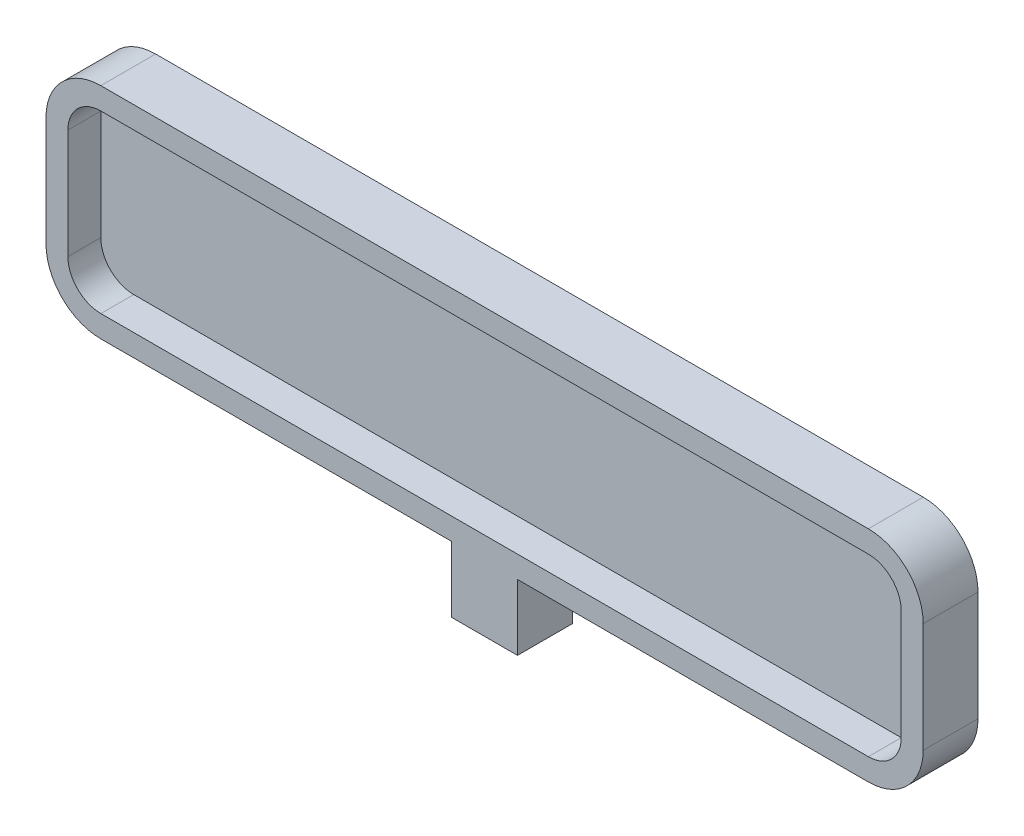
ISO-10303-21;
HEADER;
FILE_DESCRIPTION(('STEP AP214'),'2;1');
FILE_NAME('part.step','',(''),(''),'','','');
FILE_SCHEMA(('AUTOMOTIVE_DESIGN { 1 0 10303 214 1 1 1 1 }'));
ENDSEC;
DATA;
#1=APPLICATION_CONTEXT('core data for automotive mechanical design processes');
#2=APPLICATION_PROTOCOL_DEFINITION('international standard','automotive_design',2000,#1);
#3=PRODUCT_CONTEXT('',#1,'mechanical');
#4=PRODUCT('Part','Part','',(#3));
#5=PRODUCT_RELATED_PRODUCT_CATEGORY('part','',(#4));
#6=PRODUCT_DEFINITION_FORMATION('','',#4);
#7=PRODUCT_DEFINITION_CONTEXT('part definition',#1,'design');
#8=PRODUCT_DEFINITION('design','',#6,#7);
#9=PRODUCT_DEFINITION_SHAPE('','',#8);
#10=(LENGTH_UNIT() NAMED_UNIT(*) SI_UNIT(.MILLI.,.METRE.));
#11=(NAMED_UNIT(*) PLANE_ANGLE_UNIT() SI_UNIT($,.RADIAN.));
#12=(NAMED_UNIT(*) SI_UNIT($,.STERADIAN.) SOLID_ANGLE_UNIT());
#13=UNCERTAINTY_MEASURE_WITH_UNIT(LENGTH_MEASURE(1.E-05),#10,'distance_accuracy_value','');
#14=(GEOMETRIC_REPRESENTATION_CONTEXT(3) GLOBAL_UNCERTAINTY_ASSIGNED_CONTEXT((#13)) GLOBAL_UNIT_ASSIGNED_CONTEXT((#10,
#11,#12)) REPRESENTATION_CONTEXT('',''));
#15=CARTESIAN_POINT('',(0.,0.,0.));
#16=DIRECTION('',(0.,0.,1.));
#17=DIRECTION('',(1.,0.,0.));
#18=AXIS2_PLACEMENT_3D('',#15,#16,#17);
#19=CARTESIAN_POINT('',(40.,-10.,5.));
#20=DIRECTION('',(0.,1.,0.));
#21=DIRECTION('',(-1.,0.,0.));
#22=AXIS2_PLACEMENT_3D('',#19,#20,#21);
#23=PLANE('',#22);
#24=DIRECTION('',(0.,0.,1.));
#25=VECTOR('',#24,1.);
#26=CARTESIAN_POINT('',(3.,-10.,0.));
#27=LINE('',#26,#25);
#28=CARTESIAN_POINT('',(3.,-10.,0.));
#29=VERTEX_POINT('',#28);
#30=CARTESIAN_POINT('',(3.,-10.,5.));
#31=VERTEX_POINT('',#30);
#32=EDGE_CURVE('E203',#29,#31,#27,.T.);
#33=ORIENTED_EDGE('',*,*,#32,.F.);
#34=DIRECTION('',(1.,0.,0.));
#35=VECTOR('',#34,1.);
#36=CARTESIAN_POINT('',(40.,-10.,0.));
#37=LINE('',#36,#35);
#38=CARTESIAN_POINT('',(35.,-10.,0.));
#39=VERTEX_POINT('',#38);
#40=EDGE_CURVE('E315',#29,#39,#37,.T.);
#41=ORIENTED_EDGE('',*,*,#40,.T.);
#42=DIRECTION('',(0.,0.,-1.));
#43=VECTOR('',#42,1.);
#44=CARTESIAN_POINT('',(35.,-10.,5.));
#45=LINE('',#44,#43);
#46=CARTESIAN_POINT('',(35.,-10.,5.));
#47=VERTEX_POINT('',#46);
#48=EDGE_CURVE('E311',#39,#47,#45,.F.);
#49=ORIENTED_EDGE('',*,*,#48,.T.);
#50=DIRECTION('',(1.,0.,0.));
#51=VECTOR('',#50,1.);
#52=CARTESIAN_POINT('',(40.,-10.,5.));
#53=LINE('',#52,#51);
#54=EDGE_CURVE('E55',#31,#47,#53,.T.);
#55=ORIENTED_EDGE('',*,*,#54,.F.);
#56=EDGE_LOOP('',(#33,#41,#49,#55));
#57=FACE_BOUND('',#56,.T.);
#58=ADVANCED_FACE('F39',(#57),#23,.F.);
#59=DIRECTION('',(0.,0.,-1.));
#60=VECTOR('',#59,1.);
#61=CARTESIAN_POINT('',(-3.,-10.,0.));
#62=LINE('',#61,#60);
#63=CARTESIAN_POINT('',(-3.,-10.,5.));
#64=VERTEX_POINT('',#63);
#65=CARTESIAN_POINT('',(-3.,-10.,0.));
#66=VERTEX_POINT('',#65);
#67=EDGE_CURVE('E63',#64,#66,#62,.T.);
#68=ORIENTED_EDGE('',*,*,#67,.F.);
#69=CARTESIAN_POINT('',(-35.,-10.,5.));
#70=VERTEX_POINT('',#69);
#71=EDGE_CURVE('E300',#70,#64,#53,.T.);
#72=ORIENTED_EDGE('',*,*,#71,.F.);
#73=DIRECTION('',(0.,0.,-1.));
#74=VECTOR('',#73,1.);
#75=CARTESIAN_POINT('',(-35.,-10.,5.));
#76=LINE('',#75,#74);
#77=CARTESIAN_POINT('',(-35.,-10.,0.));
#78=VERTEX_POINT('',#77);
#79=EDGE_CURVE('E328',#70,#78,#76,.T.);
#80=ORIENTED_EDGE('',*,*,#79,.T.);
#81=EDGE_CURVE('E316',#78,#66,#37,.T.);
#82=ORIENTED_EDGE('',*,*,#81,.T.);
#83=EDGE_LOOP('',(#68,#72,#80,#82));
#84=FACE_BOUND('',#83,.T.);
#85=ADVANCED_FACE('F394',(#84),#23,.F.);
#86=CARTESIAN_POINT('',(-40.,9.99999999999999,5.));
#87=DIRECTION('',(1.,0.,0.));
#88=DIRECTION('',(0.,1.,0.));
#89=AXIS2_PLACEMENT_3D('',#86,#87,#88);
#90=PLANE('',#89);
#91=DIRECTION('',(0.,-1.,0.));
#92=VECTOR('',#91,1.);
#93=CARTESIAN_POINT('',(-40.,9.99999999999999,0.));
#94=LINE('',#93,#92);
#95=CARTESIAN_POINT('',(-40.,4.99999999999999,0.));
#96=VERTEX_POINT('',#95);
#97=CARTESIAN_POINT('',(-40.,-5.00000000000001,0.));
#98=VERTEX_POINT('',#97);
#99=EDGE_CURVE('E269',#96,#98,#94,.T.);
#100=ORIENTED_EDGE('',*,*,#99,.T.);
#101=DIRECTION('',(0.,0.,-1.));
#102=VECTOR('',#101,1.);
#103=CARTESIAN_POINT('',(-40.,-5.00000000000001,5.));
#104=LINE('',#103,#102);
#105=CARTESIAN_POINT('',(-40.,-5.00000000000001,5.));
#106=VERTEX_POINT('',#105);
#107=EDGE_CURVE('E349',#98,#106,#104,.F.);
#108=ORIENTED_EDGE('',*,*,#107,.T.);
#109=DIRECTION('',(0.,-1.,0.));
#110=VECTOR('',#109,1.);
#111=CARTESIAN_POINT('',(-40.,9.99999999999999,5.));
#112=LINE('',#111,#110);
#113=CARTESIAN_POINT('',(-40.,4.99999999999999,5.));
#114=VERTEX_POINT('',#113);
#115=EDGE_CURVE('E296',#114,#106,#112,.T.);
#116=ORIENTED_EDGE('',*,*,#115,.F.);
#117=DIRECTION('',(0.,0.,-1.));
#118=VECTOR('',#117,1.);
#119=CARTESIAN_POINT('',(-40.,4.99999999999999,5.));
#120=LINE('',#119,#118);
#121=EDGE_CURVE('E345',#114,#96,#120,.T.);
#122=ORIENTED_EDGE('',*,*,#121,.T.);
#123=EDGE_LOOP('',(#100,#108,#116,#122));
#124=FACE_BOUND('',#123,.T.);
#125=ADVANCED_FACE('F384',(#124),#90,.F.);
#126=CARTESIAN_POINT('',(40.,10.,5.));
#127=DIRECTION('',(-1.,0.,0.));
#128=DIRECTION('',(0.,0.,1.));
#129=AXIS2_PLACEMENT_3D('',#126,#127,#128);
#130=PLANE('',#129);
#131=DIRECTION('',(0.,1.,0.));
#132=VECTOR('',#131,1.);
#133=CARTESIAN_POINT('',(40.,10.,5.));
#134=LINE('',#133,#132);
#135=CARTESIAN_POINT('',(40.,-5.,5.));
#136=VERTEX_POINT('',#135);
#137=CARTESIAN_POINT('',(40.,5.,5.));
#138=VERTEX_POINT('',#137);
#139=EDGE_CURVE('E303',#136,#138,#134,.T.);
#140=ORIENTED_EDGE('',*,*,#139,.F.);
#141=DIRECTION('',(0.,0.,-1.));
#142=VECTOR('',#141,1.);
#143=CARTESIAN_POINT('',(40.,-5.,5.));
#144=LINE('',#143,#142);
#145=CARTESIAN_POINT('',(40.,-5.,0.));
#146=VERTEX_POINT('',#145);
#147=EDGE_CURVE('E367',#136,#146,#144,.T.);
#148=ORIENTED_EDGE('',*,*,#147,.T.);
#149=DIRECTION('',(0.,1.,0.));
#150=VECTOR('',#149,1.);
#151=CARTESIAN_POINT('',(40.,10.,0.));
#152=LINE('',#151,#150);
#153=CARTESIAN_POINT('',(40.,5.,0.));
#154=VERTEX_POINT('',#153);
#155=EDGE_CURVE('E319',#146,#154,#152,.T.);
#156=ORIENTED_EDGE('',*,*,#155,.T.);
#157=DIRECTION('',(0.,0.,-1.));
#158=VECTOR('',#157,1.);
#159=CARTESIAN_POINT('',(40.,5.,5.));
#160=LINE('',#159,#158);
#161=EDGE_CURVE('E364',#154,#138,#160,.F.);
#162=ORIENTED_EDGE('',*,*,#161,.T.);
#163=EDGE_LOOP('',(#140,#148,#156,#162));
#164=FACE_BOUND('',#163,.T.);
#165=ADVANCED_FACE('F421',(#164),#130,.F.);
#166=CARTESIAN_POINT('',(40.,10.,5.));
#167=DIRECTION('',(0.,-1.,0.));
#168=DIRECTION('',(1.,0.,0.));
#169=AXIS2_PLACEMENT_3D('',#166,#167,#168);
#170=PLANE('',#169);
#171=DIRECTION('',(-1.,0.,0.));
#172=VECTOR('',#171,1.);
#173=CARTESIAN_POINT('',(40.,10.,5.));
#174=LINE('',#173,#172);
#175=CARTESIAN_POINT('',(35.,10.,5.));
#176=VERTEX_POINT('',#175);
#177=CARTESIAN_POINT('',(-35.,9.99999999999999,5.));
#178=VERTEX_POINT('',#177);
#179=EDGE_CURVE('E307',#176,#178,#174,.T.);
#180=ORIENTED_EDGE('',*,*,#179,.F.);
#181=DIRECTION('',(0.,0.,-1.));
#182=VECTOR('',#181,1.);
#183=CARTESIAN_POINT('',(35.,10.,5.));
#184=LINE('',#183,#182);
#185=CARTESIAN_POINT('',(35.,10.,0.));
#186=VERTEX_POINT('',#185);
#187=EDGE_CURVE('E11',#176,#186,#184,.T.);
#188=ORIENTED_EDGE('',*,*,#187,.T.);
#189=DIRECTION('',(-1.,0.,0.));
#190=VECTOR('',#189,1.);
#191=CARTESIAN_POINT('',(40.,10.,0.));
#192=LINE('',#191,#190);
#193=CARTESIAN_POINT('',(-35.,9.99999999999999,0.));
#194=VERTEX_POINT('',#193);
#195=EDGE_CURVE('E299',#186,#194,#192,.T.);
#196=ORIENTED_EDGE('',*,*,#195,.T.);
#197=DIRECTION('',(0.,0.,-1.));
#198=VECTOR('',#197,1.);
#199=CARTESIAN_POINT('',(-35.,9.99999999999999,5.));
#200=LINE('',#199,#198);
#201=EDGE_CURVE('E48',#194,#178,#200,.F.);
#202=ORIENTED_EDGE('',*,*,#201,.T.);
#203=EDGE_LOOP('',(#180,#188,#196,#202));
#204=FACE_BOUND('',#203,.T.);
#205=ADVANCED_FACE('F374',(#204),#170,.F.);
#206=CARTESIAN_POINT('',(0.,0.,5.));
#207=DIRECTION('',(0.,0.,-1.));
#208=DIRECTION('',(-1.,0.,0.));
#209=AXIS2_PLACEMENT_3D('',#206,#207,#208);
#210=PLANE('',#209);
#211=DIRECTION('',(0.,-1.,0.));
#212=VECTOR('',#211,1.);
#213=CARTESIAN_POINT('',(-38.,0.,5.));
#214=LINE('',#213,#212);
#215=CARTESIAN_POINT('',(-38.,4.99999999999999,5.));
#216=VERTEX_POINT('',#215);
#217=CARTESIAN_POINT('',(-38.,-5.00000000000001,5.));
#218=VERTEX_POINT('',#217);
#219=EDGE_CURVE('E241',#216,#218,#214,.T.);
#220=ORIENTED_EDGE('',*,*,#219,.F.);
#221=CARTESIAN_POINT('',(-35.,4.99999999999999,5.));
#222=DIRECTION('',(0.,0.,-1.));
#223=DIRECTION('',(-1.,0.,0.));
#224=AXIS2_PLACEMENT_3D('',#221,#222,#223);
#225=CIRCLE('',#224,3.);
#226=CARTESIAN_POINT('',(-35.,7.99999999999999,5.));
#227=VERTEX_POINT('',#226);
#228=EDGE_CURVE('E219',#227,#216,#225,.F.);
#229=ORIENTED_EDGE('',*,*,#228,.F.);
#230=DIRECTION('',(-1.,0.,0.));
#231=VECTOR('',#230,1.);
#232=CARTESIAN_POINT('',(0.,7.99999999999999,5.));
#233=LINE('',#232,#231);
#234=CARTESIAN_POINT('',(35.,8.,5.));
#235=VERTEX_POINT('',#234);
#236=EDGE_CURVE('E255',#235,#227,#233,.T.);
#237=ORIENTED_EDGE('',*,*,#236,.F.);
#238=CARTESIAN_POINT('',(35.,5.,5.));
#239=DIRECTION('',(0.,0.,-1.));
#240=DIRECTION('',(-1.,0.,0.));
#241=AXIS2_PLACEMENT_3D('',#238,#239,#240);
#242=CIRCLE('',#241,3.);
#243=CARTESIAN_POINT('',(38.,5.,5.));
#244=VERTEX_POINT('',#243);
#245=EDGE_CURVE('E286',#244,#235,#242,.F.);
#246=ORIENTED_EDGE('',*,*,#245,.F.);
#247=DIRECTION('',(0.,1.,0.));
#248=VECTOR('',#247,1.);
#249=CARTESIAN_POINT('',(38.,0.,5.));
#250=LINE('',#249,#248);
#251=CARTESIAN_POINT('',(38.,-5.,5.));
#252=VERTEX_POINT('',#251);
#253=EDGE_CURVE('E283',#252,#244,#250,.T.);
#254=ORIENTED_EDGE('',*,*,#253,.F.);
#255=CARTESIAN_POINT('',(35.,-5.,5.));
#256=DIRECTION('',(0.,0.,-1.));
#257=DIRECTION('',(-1.,0.,0.));
#258=AXIS2_PLACEMENT_3D('',#255,#256,#257);
#259=CIRCLE('',#258,3.);
#260=CARTESIAN_POINT('',(35.,-8.,5.));
#261=VERTEX_POINT('',#260);
#262=EDGE_CURVE('E279',#261,#252,#259,.F.);
#263=ORIENTED_EDGE('',*,*,#262,.F.);
#264=DIRECTION('',(1.,0.,0.));
#265=VECTOR('',#264,1.);
#266=CARTESIAN_POINT('',(0.,-8.00000000000001,5.));
#267=LINE('',#266,#265);
#268=CARTESIAN_POINT('',(-35.,-8.00000000000001,5.));
#269=VERTEX_POINT('',#268);
#270=EDGE_CURVE('E276',#269,#261,#267,.T.);
#271=ORIENTED_EDGE('',*,*,#270,.F.);
#272=CARTESIAN_POINT('',(-35.,-5.00000000000001,5.));
#273=DIRECTION('',(0.,0.,-1.));
#274=DIRECTION('',(-1.,0.,0.));
#275=AXIS2_PLACEMENT_3D('',#272,#273,#274);
#276=CIRCLE('',#275,3.);
#277=EDGE_CURVE('E264',#218,#269,#276,.F.);
#278=ORIENTED_EDGE('',*,*,#277,.F.);
#279=EDGE_LOOP('',(#220,#229,#237,#246,#254,#263,#271,#278));
#280=FACE_BOUND('',#279,.T.);
#281=ORIENTED_EDGE('',*,*,#115,.T.);
#282=CARTESIAN_POINT('',(-35.,-5.00000000000001,5.));
#283=DIRECTION('',(0.,0.,-1.));
#284=DIRECTION('',(-1.,0.,0.));
#285=AXIS2_PLACEMENT_3D('',#282,#283,#284);
#286=CIRCLE('',#285,5.);
#287=EDGE_CURVE('E361',#106,#70,#286,.F.);
#288=ORIENTED_EDGE('',*,*,#287,.T.);
#289=ORIENTED_EDGE('',*,*,#71,.T.);
#290=DIRECTION('',(0.,1.,0.));
#291=VECTOR('',#290,1.);
#292=CARTESIAN_POINT('',(-3.,-16.,5.));
#293=LINE('',#292,#291);
#294=CARTESIAN_POINT('',(-3.,-16.,5.));
#295=VERTEX_POINT('',#294);
#296=EDGE_CURVE('E186',#295,#64,#293,.T.);
#297=ORIENTED_EDGE('',*,*,#296,.F.);
#298=DIRECTION('',(-1.,0.,0.));
#299=VECTOR('',#298,1.);
#300=CARTESIAN_POINT('',(-3.,-16.,5.));
#301=LINE('',#300,#299);
#302=CARTESIAN_POINT('',(3.,-16.,5.));
#303=VERTEX_POINT('',#302);
#304=EDGE_CURVE('E178',#303,#295,#301,.T.);
#305=ORIENTED_EDGE('',*,*,#304,.F.);
#306=DIRECTION('',(0.,1.,0.));
#307=VECTOR('',#306,1.);
#308=CARTESIAN_POINT('',(3.,-16.,5.));
#309=LINE('',#308,#307);
#310=EDGE_CURVE('E183',#303,#31,#309,.T.);
#311=ORIENTED_EDGE('',*,*,#310,.T.);
#312=ORIENTED_EDGE('',*,*,#54,.T.);
#313=CARTESIAN_POINT('',(35.,-5.,5.));
#314=DIRECTION('',(0.,0.,-1.));
#315=DIRECTION('',(-1.,0.,0.));
#316=AXIS2_PLACEMENT_3D('',#313,#314,#315);
#317=CIRCLE('',#316,5.);
#318=EDGE_CURVE('E358',#47,#136,#317,.F.);
#319=ORIENTED_EDGE('',*,*,#318,.T.);
#320=ORIENTED_EDGE('',*,*,#139,.T.);
#321=CARTESIAN_POINT('',(35.,5.,5.));
#322=DIRECTION('',(0.,0.,-1.));
#323=DIRECTION('',(-1.,0.,0.));
#324=AXIS2_PLACEMENT_3D('',#321,#322,#323);
#325=CIRCLE('',#324,5.);
#326=EDGE_CURVE('E355',#138,#176,#325,.F.);
#327=ORIENTED_EDGE('',*,*,#326,.T.);
#328=ORIENTED_EDGE('',*,*,#179,.T.);
#329=CARTESIAN_POINT('',(-35.,4.99999999999999,5.));
#330=DIRECTION('',(0.,0.,-1.));
#331=DIRECTION('',(-1.,0.,0.));
#332=AXIS2_PLACEMENT_3D('',#329,#330,#331);
#333=CIRCLE('',#332,5.);
#334=EDGE_CURVE('E352',#178,#114,#333,.F.);
#335=ORIENTED_EDGE('',*,*,#334,.T.);
#336=EDGE_LOOP('',(#281,#288,#289,#297,#305,#311,#312,#319,#320,#327,#328,#335));
#337=FACE_BOUND('',#336,.T.);
#338=ADVANCED_FACE('F181',(#280,#337),#210,.F.);
#339=CARTESIAN_POINT('',(0.,0.,0.));
#340=DIRECTION('',(0.,0.,-1.));
#341=DIRECTION('',(-1.,0.,0.));
#342=AXIS2_PLACEMENT_3D('',#339,#340,#341);
#343=PLANE('',#342);
#344=ORIENTED_EDGE('',*,*,#81,.F.);
#345=CARTESIAN_POINT('',(-35.,-5.00000000000001,0.));
#346=DIRECTION('',(0.,0.,-1.));
#347=DIRECTION('',(-1.,0.,0.));
#348=AXIS2_PLACEMENT_3D('',#345,#346,#347);
#349=CIRCLE('',#348,5.);
#350=EDGE_CURVE('E342',#78,#98,#349,.T.);
#351=ORIENTED_EDGE('',*,*,#350,.T.);
#352=ORIENTED_EDGE('',*,*,#99,.F.);
#353=CARTESIAN_POINT('',(-35.,4.99999999999999,0.));
#354=DIRECTION('',(0.,0.,-1.));
#355=DIRECTION('',(-1.,0.,0.));
#356=AXIS2_PLACEMENT_3D('',#353,#354,#355);
#357=CIRCLE('',#356,5.);
#358=EDGE_CURVE('E332',#96,#194,#357,.T.);
#359=ORIENTED_EDGE('',*,*,#358,.T.);
#360=ORIENTED_EDGE('',*,*,#195,.F.);
#361=CARTESIAN_POINT('',(35.,5.,0.));
#362=DIRECTION('',(0.,0.,-1.));
#363=DIRECTION('',(-1.,0.,0.));
#364=AXIS2_PLACEMENT_3D('',#361,#362,#363);
#365=CIRCLE('',#364,5.);
#366=EDGE_CURVE('E335',#186,#154,#365,.T.);
#367=ORIENTED_EDGE('',*,*,#366,.T.);
#368=ORIENTED_EDGE('',*,*,#155,.F.);
#369=CARTESIAN_POINT('',(35.,-5.,0.));
#370=DIRECTION('',(0.,0.,-1.));
#371=DIRECTION('',(-1.,0.,0.));
#372=AXIS2_PLACEMENT_3D('',#369,#370,#371);
#373=CIRCLE('',#372,5.);
#374=EDGE_CURVE('E338',#146,#39,#373,.T.);
#375=ORIENTED_EDGE('',*,*,#374,.T.);
#376=ORIENTED_EDGE('',*,*,#40,.F.);
#377=DIRECTION('',(0.,1.,0.));
#378=VECTOR('',#377,1.);
#379=CARTESIAN_POINT('',(3.,-16.,0.));
#380=LINE('',#379,#378);
#381=CARTESIAN_POINT('',(3.,-16.,0.));
#382=VERTEX_POINT('',#381);
#383=EDGE_CURVE('E401',#382,#29,#380,.T.);
#384=ORIENTED_EDGE('',*,*,#383,.F.);
#385=DIRECTION('',(1.,0.,0.));
#386=VECTOR('',#385,1.);
#387=CARTESIAN_POINT('',(-3.,-16.,0.));
#388=LINE('',#387,#386);
#389=CARTESIAN_POINT('',(-3.,-16.,0.));
#390=VERTEX_POINT('',#389);
#391=EDGE_CURVE('E196',#390,#382,#388,.T.);
#392=ORIENTED_EDGE('',*,*,#391,.F.);
#393=DIRECTION('',(0.,1.,0.));
#394=VECTOR('',#393,1.);
#395=CARTESIAN_POINT('',(-3.,-16.,0.));
#396=LINE('',#395,#394);
#397=EDGE_CURVE('E212',#390,#66,#396,.T.);
#398=ORIENTED_EDGE('',*,*,#397,.T.);
#399=EDGE_LOOP('',(#344,#351,#352,#359,#360,#367,#368,#375,#376,#384,#392,#398));
#400=FACE_BOUND('',#399,.T.);
#401=ADVANCED_FACE('F388',(#400),#343,.T.);
#402=CARTESIAN_POINT('',(-35.,-5.00000000000001,5.));
#403=DIRECTION('',(0.,0.,-1.));
#404=DIRECTION('',(-1.,0.,0.));
#405=AXIS2_PLACEMENT_3D('',#402,#403,#404);
#406=CYLINDRICAL_SURFACE('',#405,5.);
#407=ORIENTED_EDGE('',*,*,#287,.F.);
#408=ORIENTED_EDGE('',*,*,#107,.F.);
#409=ORIENTED_EDGE('',*,*,#350,.F.);
#410=ORIENTED_EDGE('',*,*,#79,.F.);
#411=EDGE_LOOP('',(#407,#408,#409,#410));
#412=FACE_BOUND('',#411,.T.);
#413=ADVANCED_FACE('F393',(#412),#406,.T.);
#414=CARTESIAN_POINT('',(35.,-5.,5.));
#415=DIRECTION('',(0.,0.,-1.));
#416=DIRECTION('',(-1.,0.,0.));
#417=AXIS2_PLACEMENT_3D('',#414,#415,#416);
#418=CYLINDRICAL_SURFACE('',#417,5.);
#419=ORIENTED_EDGE('',*,*,#318,.F.);
#420=ORIENTED_EDGE('',*,*,#48,.F.);
#421=ORIENTED_EDGE('',*,*,#374,.F.);
#422=ORIENTED_EDGE('',*,*,#147,.F.);
#423=EDGE_LOOP('',(#419,#420,#421,#422));
#424=FACE_BOUND('',#423,.T.);
#425=ADVANCED_FACE('F427',(#424),#418,.T.);
#426=CARTESIAN_POINT('',(35.,5.,5.));
#427=DIRECTION('',(0.,0.,-1.));
#428=DIRECTION('',(-1.,0.,0.));
#429=AXIS2_PLACEMENT_3D('',#426,#427,#428);
#430=CYLINDRICAL_SURFACE('',#429,5.);
#431=ORIENTED_EDGE('',*,*,#326,.F.);
#432=ORIENTED_EDGE('',*,*,#161,.F.);
#433=ORIENTED_EDGE('',*,*,#366,.F.);
#434=ORIENTED_EDGE('',*,*,#187,.F.);
#435=EDGE_LOOP('',(#431,#432,#433,#434));
#436=FACE_BOUND('',#435,.T.);
#437=ADVANCED_FACE('F429',(#436),#430,.T.);
#438=CARTESIAN_POINT('',(-35.,4.99999999999999,5.));
#439=DIRECTION('',(0.,0.,-1.));
#440=DIRECTION('',(-1.,0.,0.));
#441=AXIS2_PLACEMENT_3D('',#438,#439,#440);
#442=CYLINDRICAL_SURFACE('',#441,5.);
#443=ORIENTED_EDGE('',*,*,#334,.F.);
#444=ORIENTED_EDGE('',*,*,#201,.F.);
#445=ORIENTED_EDGE('',*,*,#358,.F.);
#446=ORIENTED_EDGE('',*,*,#121,.F.);
#447=EDGE_LOOP('',(#443,#444,#445,#446));
#448=FACE_BOUND('',#447,.T.);
#449=ADVANCED_FACE('F41',(#448),#442,.T.);
#450=CARTESIAN_POINT('',(-38.,9.99999999999999,5.));
#451=DIRECTION('',(1.,0.,0.));
#452=DIRECTION('',(0.,1.,0.));
#453=AXIS2_PLACEMENT_3D('',#450,#451,#452);
#454=PLANE('',#453);
#455=DIRECTION('',(0.,-1.,0.));
#456=VECTOR('',#455,1.);
#457=CARTESIAN_POINT('',(-38.,0.,2.));
#458=LINE('',#457,#456);
#459=CARTESIAN_POINT('',(-38.,4.99999999999999,2.));
#460=VERTEX_POINT('',#459);
#461=CARTESIAN_POINT('',(-38.,-5.00000000000001,2.));
#462=VERTEX_POINT('',#461);
#463=EDGE_CURVE('E205',#460,#462,#458,.T.);
#464=ORIENTED_EDGE('',*,*,#463,.F.);
#465=DIRECTION('',(0.,0.,1.));
#466=VECTOR('',#465,1.);
#467=CARTESIAN_POINT('',(-38.,4.99999999999999,5.));
#468=LINE('',#467,#466);
#469=EDGE_CURVE('E220',#216,#460,#468,.F.);
#470=ORIENTED_EDGE('',*,*,#469,.F.);
#471=ORIENTED_EDGE('',*,*,#219,.T.);
#472=DIRECTION('',(0.,0.,1.));
#473=VECTOR('',#472,1.);
#474=CARTESIAN_POINT('',(-38.,-5.00000000000001,5.));
#475=LINE('',#474,#473);
#476=EDGE_CURVE('E216',#462,#218,#475,.T.);
#477=ORIENTED_EDGE('',*,*,#476,.F.);
#478=EDGE_LOOP('',(#464,#470,#471,#477));
#479=FACE_BOUND('',#478,.T.);
#480=ADVANCED_FACE('F436',(#479),#454,.T.);
#481=CARTESIAN_POINT('',(40.,-8.,5.));
#482=DIRECTION('',(0.,1.,0.));
#483=DIRECTION('',(-1.,0.,0.));
#484=AXIS2_PLACEMENT_3D('',#481,#482,#483);
#485=PLANE('',#484);
#486=ORIENTED_EDGE('',*,*,#270,.T.);
#487=DIRECTION('',(0.,0.,1.));
#488=VECTOR('',#487,1.);
#489=CARTESIAN_POINT('',(35.,-8.,5.));
#490=LINE('',#489,#488);
#491=CARTESIAN_POINT('',(35.,-8.,2.));
#492=VERTEX_POINT('',#491);
#493=EDGE_CURVE('E252',#492,#261,#490,.T.);
#494=ORIENTED_EDGE('',*,*,#493,.F.);
#495=DIRECTION('',(1.,0.,0.));
#496=VECTOR('',#495,1.);
#497=CARTESIAN_POINT('',(0.,-8.00000000000001,2.));
#498=LINE('',#497,#496);
#499=CARTESIAN_POINT('',(-35.,-8.00000000000001,2.));
#500=VERTEX_POINT('',#499);
#501=EDGE_CURVE('E210',#500,#492,#498,.T.);
#502=ORIENTED_EDGE('',*,*,#501,.F.);
#503=DIRECTION('',(0.,0.,1.));
#504=VECTOR('',#503,1.);
#505=CARTESIAN_POINT('',(-35.,-8.00000000000001,5.));
#506=LINE('',#505,#504);
#507=EDGE_CURVE('E236',#269,#500,#506,.F.);
#508=ORIENTED_EDGE('',*,*,#507,.F.);
#509=EDGE_LOOP('',(#486,#494,#502,#508));
#510=FACE_BOUND('',#509,.T.);
#511=ADVANCED_FACE('F482',(#510),#485,.T.);
#512=CARTESIAN_POINT('',(38.,10.,5.));
#513=DIRECTION('',(-1.,0.,0.));
#514=DIRECTION('',(0.,0.,1.));
#515=AXIS2_PLACEMENT_3D('',#512,#513,#514);
#516=PLANE('',#515);
#517=ORIENTED_EDGE('',*,*,#253,.T.);
#518=DIRECTION('',(0.,0.,1.));
#519=VECTOR('',#518,1.);
#520=CARTESIAN_POINT('',(38.,5.,5.));
#521=LINE('',#520,#519);
#522=CARTESIAN_POINT('',(38.,5.,2.));
#523=VERTEX_POINT('',#522);
#524=EDGE_CURVE('E261',#523,#244,#521,.T.);
#525=ORIENTED_EDGE('',*,*,#524,.F.);
#526=DIRECTION('',(0.,1.,0.));
#527=VECTOR('',#526,1.);
#528=CARTESIAN_POINT('',(38.,0.,2.));
#529=LINE('',#528,#527);
#530=CARTESIAN_POINT('',(38.,-5.,2.));
#531=VERTEX_POINT('',#530);
#532=EDGE_CURVE('E228',#531,#523,#529,.T.);
#533=ORIENTED_EDGE('',*,*,#532,.F.);
#534=DIRECTION('',(0.,0.,1.));
#535=VECTOR('',#534,1.);
#536=CARTESIAN_POINT('',(38.,-5.,5.));
#537=LINE('',#536,#535);
#538=EDGE_CURVE('E256',#252,#531,#537,.F.);
#539=ORIENTED_EDGE('',*,*,#538,.F.);
#540=EDGE_LOOP('',(#517,#525,#533,#539));
#541=FACE_BOUND('',#540,.T.);
#542=ADVANCED_FACE('F478',(#541),#516,.T.);
#543=CARTESIAN_POINT('',(40.,8.,5.));
#544=DIRECTION('',(0.,-1.,0.));
#545=DIRECTION('',(1.,0.,0.));
#546=AXIS2_PLACEMENT_3D('',#543,#544,#545);
#547=PLANE('',#546);
#548=ORIENTED_EDGE('',*,*,#236,.T.);
#549=DIRECTION('',(0.,0.,1.));
#550=VECTOR('',#549,1.);
#551=CARTESIAN_POINT('',(-35.,7.99999999999999,5.));
#552=LINE('',#551,#550);
#553=CARTESIAN_POINT('',(-35.,7.99999999999999,2.));
#554=VERTEX_POINT('',#553);
#555=EDGE_CURVE('E260',#554,#227,#552,.T.);
#556=ORIENTED_EDGE('',*,*,#555,.F.);
#557=DIRECTION('',(-1.,0.,0.));
#558=VECTOR('',#557,1.);
#559=CARTESIAN_POINT('',(0.,7.99999999999999,2.));
#560=LINE('',#559,#558);
#561=CARTESIAN_POINT('',(35.,8.,2.));
#562=VERTEX_POINT('',#561);
#563=EDGE_CURVE('E237',#562,#554,#560,.T.);
#564=ORIENTED_EDGE('',*,*,#563,.F.);
#565=DIRECTION('',(0.,0.,1.));
#566=VECTOR('',#565,1.);
#567=CARTESIAN_POINT('',(35.,8.,5.));
#568=LINE('',#567,#566);
#569=EDGE_CURVE('E265',#235,#562,#568,.F.);
#570=ORIENTED_EDGE('',*,*,#569,.F.);
#571=EDGE_LOOP('',(#548,#556,#564,#570));
#572=FACE_BOUND('',#571,.T.);
#573=ADVANCED_FACE('F474',(#572),#547,.T.);
#574=CARTESIAN_POINT('',(0.,0.,2.));
#575=DIRECTION('',(0.,0.,-1.));
#576=DIRECTION('',(-1.,0.,0.));
#577=AXIS2_PLACEMENT_3D('',#574,#575,#576);
#578=PLANE('',#577);
#579=ORIENTED_EDGE('',*,*,#501,.T.);
#580=CARTESIAN_POINT('',(35.,-5.,2.));
#581=DIRECTION('',(0.,0.,-1.));
#582=DIRECTION('',(-1.,0.,0.));
#583=AXIS2_PLACEMENT_3D('',#580,#581,#582);
#584=CIRCLE('',#583,3.);
#585=EDGE_CURVE('E231',#531,#492,#584,.T.);
#586=ORIENTED_EDGE('',*,*,#585,.F.);
#587=ORIENTED_EDGE('',*,*,#532,.T.);
#588=CARTESIAN_POINT('',(35.,5.,2.));
#589=DIRECTION('',(0.,0.,-1.));
#590=DIRECTION('',(-1.,0.,0.));
#591=AXIS2_PLACEMENT_3D('',#588,#589,#590);
#592=CIRCLE('',#591,3.);
#593=EDGE_CURVE('E235',#562,#523,#592,.T.);
#594=ORIENTED_EDGE('',*,*,#593,.F.);
#595=ORIENTED_EDGE('',*,*,#563,.T.);
#596=CARTESIAN_POINT('',(-35.,4.99999999999999,2.));
#597=DIRECTION('',(0.,0.,-1.));
#598=DIRECTION('',(-1.,0.,0.));
#599=AXIS2_PLACEMENT_3D('',#596,#597,#598);
#600=CIRCLE('',#599,3.);
#601=EDGE_CURVE('E232',#460,#554,#600,.T.);
#602=ORIENTED_EDGE('',*,*,#601,.F.);
#603=ORIENTED_EDGE('',*,*,#463,.T.);
#604=CARTESIAN_POINT('',(-35.,-5.00000000000001,2.));
#605=DIRECTION('',(0.,0.,-1.));
#606=DIRECTION('',(-1.,0.,0.));
#607=AXIS2_PLACEMENT_3D('',#604,#605,#606);
#608=CIRCLE('',#607,3.);
#609=EDGE_CURVE('E224',#500,#462,#608,.T.);
#610=ORIENTED_EDGE('',*,*,#609,.F.);
#611=EDGE_LOOP('',(#579,#586,#587,#594,#595,#602,#603,#610));
#612=FACE_BOUND('',#611,.T.);
#613=ADVANCED_FACE('F470',(#612),#578,.F.);
#614=CARTESIAN_POINT('',(-35.,-5.00000000000001,5.));
#615=DIRECTION('',(0.,0.,-1.));
#616=DIRECTION('',(-1.,0.,0.));
#617=AXIS2_PLACEMENT_3D('',#614,#615,#616);
#618=CYLINDRICAL_SURFACE('',#617,3.);
#619=ORIENTED_EDGE('',*,*,#277,.T.);
#620=ORIENTED_EDGE('',*,*,#507,.T.);
#621=ORIENTED_EDGE('',*,*,#609,.T.);
#622=ORIENTED_EDGE('',*,*,#476,.T.);
#623=EDGE_LOOP('',(#619,#620,#621,#622));
#624=FACE_BOUND('',#623,.T.);
#625=ADVANCED_FACE('F466',(#624),#618,.F.);
#626=CARTESIAN_POINT('',(35.,-5.,5.));
#627=DIRECTION('',(0.,0.,-1.));
#628=DIRECTION('',(-1.,0.,0.));
#629=AXIS2_PLACEMENT_3D('',#626,#627,#628);
#630=CYLINDRICAL_SURFACE('',#629,3.);
#631=ORIENTED_EDGE('',*,*,#262,.T.);
#632=ORIENTED_EDGE('',*,*,#538,.T.);
#633=ORIENTED_EDGE('',*,*,#585,.T.);
#634=ORIENTED_EDGE('',*,*,#493,.T.);
#635=EDGE_LOOP('',(#631,#632,#633,#634));
#636=FACE_BOUND('',#635,.T.);
#637=ADVANCED_FACE('F462',(#636),#630,.F.);
#638=CARTESIAN_POINT('',(35.,5.,5.));
#639=DIRECTION('',(0.,0.,-1.));
#640=DIRECTION('',(-1.,0.,0.));
#641=AXIS2_PLACEMENT_3D('',#638,#639,#640);
#642=CYLINDRICAL_SURFACE('',#641,3.);
#643=ORIENTED_EDGE('',*,*,#245,.T.);
#644=ORIENTED_EDGE('',*,*,#569,.T.);
#645=ORIENTED_EDGE('',*,*,#593,.T.);
#646=ORIENTED_EDGE('',*,*,#524,.T.);
#647=EDGE_LOOP('',(#643,#644,#645,#646));
#648=FACE_BOUND('',#647,.T.);
#649=ADVANCED_FACE('F458',(#648),#642,.F.);
#650=CARTESIAN_POINT('',(-35.,4.99999999999999,5.));
#651=DIRECTION('',(0.,0.,-1.));
#652=DIRECTION('',(-1.,0.,0.));
#653=AXIS2_PLACEMENT_3D('',#650,#651,#652);
#654=CYLINDRICAL_SURFACE('',#653,3.);
#655=ORIENTED_EDGE('',*,*,#228,.T.);
#656=ORIENTED_EDGE('',*,*,#469,.T.);
#657=ORIENTED_EDGE('',*,*,#601,.T.);
#658=ORIENTED_EDGE('',*,*,#555,.T.);
#659=EDGE_LOOP('',(#655,#656,#657,#658));
#660=FACE_BOUND('',#659,.T.);
#661=ADVANCED_FACE('F455',(#660),#654,.F.);
#662=CARTESIAN_POINT('',(3.,-16.,0.));
#663=DIRECTION('',(-1.,0.,0.));
#664=DIRECTION('',(0.,-1.,0.));
#665=AXIS2_PLACEMENT_3D('',#662,#663,#664);
#666=PLANE('',#665);
#667=ORIENTED_EDGE('',*,*,#32,.T.);
#668=ORIENTED_EDGE('',*,*,#310,.F.);
#669=DIRECTION('',(0.,0.,1.));
#670=VECTOR('',#669,1.);
#671=CARTESIAN_POINT('',(3.,-16.,0.));
#672=LINE('',#671,#670);
#673=EDGE_CURVE('E191',#382,#303,#672,.T.);
#674=ORIENTED_EDGE('',*,*,#673,.F.);
#675=ORIENTED_EDGE('',*,*,#383,.T.);
#676=EDGE_LOOP('',(#667,#668,#674,#675));
#677=FACE_BOUND('',#676,.T.);
#678=ADVANCED_FACE('F202',(#677),#666,.F.);
#679=CARTESIAN_POINT('',(-3.,-16.,0.));
#680=DIRECTION('',(1.,0.,0.));
#681=DIRECTION('',(0.,1.,0.));
#682=AXIS2_PLACEMENT_3D('',#679,#680,#681);
#683=PLANE('',#682);
#684=ORIENTED_EDGE('',*,*,#67,.T.);
#685=ORIENTED_EDGE('',*,*,#397,.F.);
#686=DIRECTION('',(0.,0.,-1.));
#687=VECTOR('',#686,1.);
#688=CARTESIAN_POINT('',(-3.,-16.,0.));
#689=LINE('',#688,#687);
#690=EDGE_CURVE('E190',#295,#390,#689,.T.);
#691=ORIENTED_EDGE('',*,*,#690,.F.);
#692=ORIENTED_EDGE('',*,*,#296,.T.);
#693=EDGE_LOOP('',(#684,#685,#691,#692));
#694=FACE_BOUND('',#693,.T.);
#695=ADVANCED_FACE('F396',(#694),#683,.F.);
#696=CARTESIAN_POINT('',(0.,-16.,0.));
#697=DIRECTION('',(0.,1.,0.));
#698=DIRECTION('',(0.,0.,1.));
#699=AXIS2_PLACEMENT_3D('',#696,#697,#698);
#700=PLANE('',#699);
#701=CARTESIAN_POINT('',(0.,-16.,2.5));
#702=DIRECTION('',(0.,-1.,0.));
#703=DIRECTION('',(0.,0.,-1.));
#704=AXIS2_PLACEMENT_3D('',#701,#702,#703);
#705=CIRCLE('',#704,1.425);
#706=CARTESIAN_POINT('',(0.,-16.,1.075));
#707=VERTEX_POINT('',#706);
#708=EDGE_CURVE('E509',#707,#707,#705,.T.);
#709=ORIENTED_EDGE('',*,*,#708,.F.);
#710=EDGE_LOOP('',(#709));
#711=FACE_BOUND('',#710,.T.);
#712=ORIENTED_EDGE('',*,*,#673,.T.);
#713=ORIENTED_EDGE('',*,*,#304,.T.);
#714=ORIENTED_EDGE('',*,*,#690,.T.);
#715=ORIENTED_EDGE('',*,*,#391,.T.);
#716=EDGE_LOOP('',(#712,#713,#714,#715));
#717=FACE_BOUND('',#716,.T.);
#718=ADVANCED_FACE('F194',(#711,#717),#700,.F.);
#719=CARTESIAN_POINT('',(0.,-12.,2.5));
#720=DIRECTION('',(0.,-1.,0.));
#721=DIRECTION('',(0.,0.,-1.));
#722=AXIS2_PLACEMENT_3D('',#719,#720,#721);
#723=CYLINDRICAL_SURFACE('',#722,1.425);
#724=CARTESIAN_POINT('',(0.,-12.,2.5));
#725=DIRECTION('',(0.,-1.,0.));
#726=DIRECTION('',(0.,0.,-1.));
#727=AXIS2_PLACEMENT_3D('',#724,#725,#726);
#728=CIRCLE('',#727,1.425);
#729=CARTESIAN_POINT('',(0.,-12.,1.075));
#730=VERTEX_POINT('',#729);
#731=EDGE_CURVE('E406',#730,#730,#728,.T.);
#732=ORIENTED_EDGE('',*,*,#731,.F.);
#733=EDGE_LOOP('',(#732));
#734=FACE_BOUND('',#733,.T.);
#735=ORIENTED_EDGE('',*,*,#708,.T.);
#736=EDGE_LOOP('',(#735));
#737=FACE_BOUND('',#736,.T.);
#738=ADVANCED_FACE('F496',(#734,#737),#723,.F.);
#739=CARTESIAN_POINT('',(0.,-12.,2.5));
#740=DIRECTION('',(0.,-1.,0.));
#741=DIRECTION('',(0.,0.,-1.));
#742=AXIS2_PLACEMENT_3D('',#739,#740,#741);
#743=PLANE('',#742);
#744=ORIENTED_EDGE('',*,*,#731,.T.);
#745=EDGE_LOOP('',(#744));
#746=FACE_BOUND('',#745,.T.);
#747=ADVANCED_FACE('F500',(#746),#743,.T.);
#748=CLOSED_SHELL('',(#58,#85,#125,#165,#205,#338,#401,#413,#425,#437,#449,#480,#511,#542,#573,
#613,#625,#637,#649,#661,#678,#695,#718,#738,#747));
#749=MANIFOLD_SOLID_BREP('B2',#748);
#750=ADVANCED_BREP_SHAPE_REPRESENTATION('',(#18,#749),#14);
#751=SHAPE_DEFINITION_REPRESENTATION(#9,#750);
ENDSEC;
END-ISO-10303-21;
